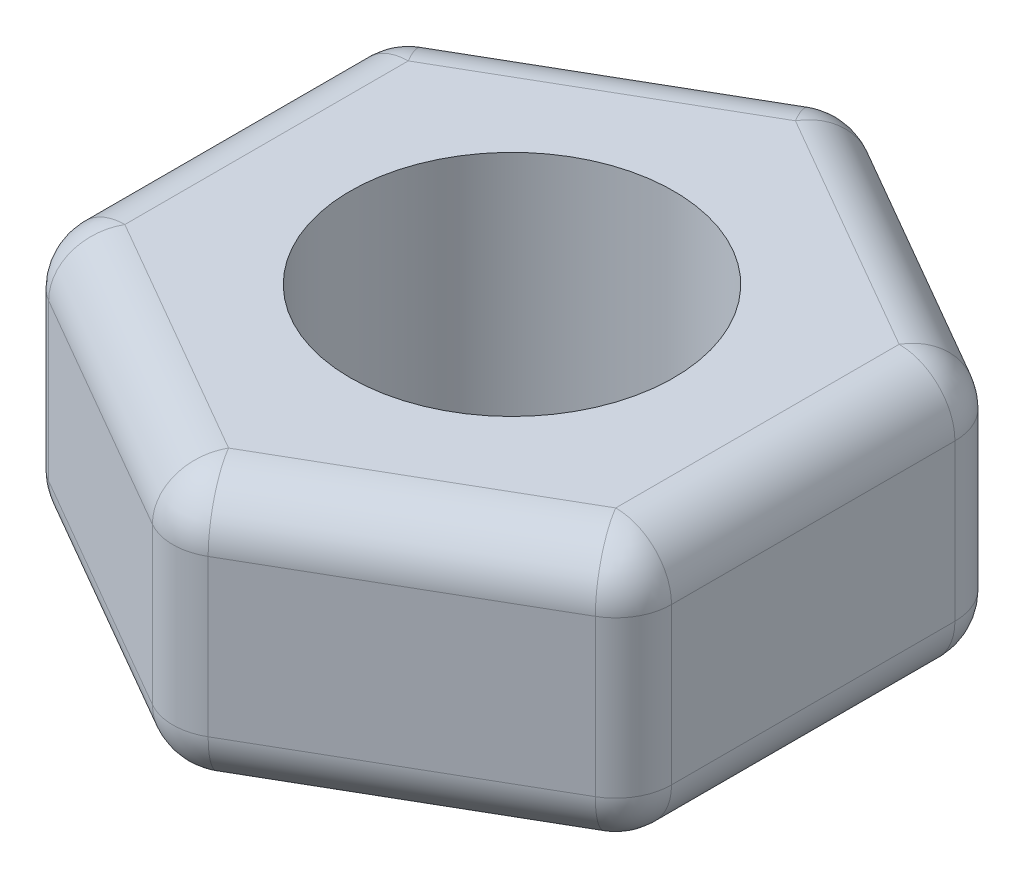
ISO-10303-21;
HEADER;
FILE_DESCRIPTION(('STEP AP214'),'2;1');
FILE_NAME('part.step','',(''),(''),'','','');
FILE_SCHEMA(('AUTOMOTIVE_DESIGN { 1 0 10303 214 1 1 1 1 }'));
ENDSEC;
DATA;
#1=APPLICATION_CONTEXT('core data for automotive mechanical design processes');
#2=APPLICATION_PROTOCOL_DEFINITION('international standard','automotive_design',2000,#1);
#3=PRODUCT_CONTEXT('',#1,'mechanical');
#4=PRODUCT('Part','Part','',(#3));
#5=PRODUCT_RELATED_PRODUCT_CATEGORY('part','',(#4));
#6=PRODUCT_DEFINITION_FORMATION('','',#4);
#7=PRODUCT_DEFINITION_CONTEXT('part definition',#1,'design');
#8=PRODUCT_DEFINITION('design','',#6,#7);
#9=PRODUCT_DEFINITION_SHAPE('','',#8);
#10=(LENGTH_UNIT() NAMED_UNIT(*) SI_UNIT(.MILLI.,.METRE.));
#11=(NAMED_UNIT(*) PLANE_ANGLE_UNIT() SI_UNIT($,.RADIAN.));
#12=(NAMED_UNIT(*) SI_UNIT($,.STERADIAN.) SOLID_ANGLE_UNIT());
#13=UNCERTAINTY_MEASURE_WITH_UNIT(LENGTH_MEASURE(1.E-05),#10,'distance_accuracy_value','');
#14=(GEOMETRIC_REPRESENTATION_CONTEXT(3) GLOBAL_UNCERTAINTY_ASSIGNED_CONTEXT((#13)) GLOBAL_UNIT_ASSIGNED_CONTEXT((#10,
#11,#12)) REPRESENTATION_CONTEXT('',''));
#15=CARTESIAN_POINT('',(0.,0.,0.));
#16=DIRECTION('',(0.,0.,1.));
#17=DIRECTION('',(1.,0.,0.));
#18=AXIS2_PLACEMENT_3D('',#15,#16,#17);
#19=CARTESIAN_POINT('',(0.,2.4,0.));
#20=DIRECTION('',(0.,1.,0.));
#21=DIRECTION('',(0.,0.,1.));
#22=AXIS2_PLACEMENT_3D('',#19,#20,#21);
#23=PLANE('',#22);
#24=DIRECTION('',(-0.866025403784438,0.,0.500000000000001));
#25=VECTOR('',#24,1.);
#26=CARTESIAN_POINT('',(-2.45000000000001,2.4,-1.12583302491977));
#27=LINE('',#26,#25);
#28=CARTESIAN_POINT('',(0.,2.4,-2.54034118443436));
#29=VERTEX_POINT('',#28);
#30=CARTESIAN_POINT('',(-2.20000000000001,2.4,-1.27017059221717));
#31=VERTEX_POINT('',#30);
#32=EDGE_CURVE('E43',#29,#31,#27,.T.);
#33=ORIENTED_EDGE('',*,*,#32,.T.);
#34=DIRECTION('',(0.,0.,1.));
#35=VECTOR('',#34,1.);
#36=CARTESIAN_POINT('',(-2.2,2.4,1.558845726812));
#37=LINE('',#36,#35);
#38=CARTESIAN_POINT('',(-2.2,2.4,1.27017059221719));
#39=VERTEX_POINT('',#38);
#40=EDGE_CURVE('E11',#31,#39,#37,.T.);
#41=ORIENTED_EDGE('',*,*,#40,.T.);
#42=DIRECTION('',(0.866025403784442,0.,0.499999999999995));
#43=VECTOR('',#42,1.);
#44=CARTESIAN_POINT('',(0.25000000000002,2.4,2.68467875173176));
#45=LINE('',#44,#43);
#46=CARTESIAN_POINT('',(0.,2.4,2.54034118443435));
#47=VERTEX_POINT('',#46);
#48=EDGE_CURVE('E267',#39,#47,#45,.T.);
#49=ORIENTED_EDGE('',*,*,#48,.T.);
#50=DIRECTION('',(0.866025403784435,0.,-0.500000000000007));
#51=VECTOR('',#50,1.);
#52=CARTESIAN_POINT('',(2.45000000000001,2.4,1.12583302491975));
#53=LINE('',#52,#51);
#54=CARTESIAN_POINT('',(2.20000000000001,2.4,1.27017059221716));
#55=VERTEX_POINT('',#54);
#56=EDGE_CURVE('E265',#47,#55,#53,.T.);
#57=ORIENTED_EDGE('',*,*,#56,.T.);
#58=DIRECTION('',(0.,0.,-1.));
#59=VECTOR('',#58,1.);
#60=CARTESIAN_POINT('',(2.19999999999998,2.4,-1.55884572681202));
#61=LINE('',#60,#59);
#62=CARTESIAN_POINT('',(2.19999999999999,2.4,-1.27017059221721));
#63=VERTEX_POINT('',#62);
#64=EDGE_CURVE('E270',#55,#63,#61,.T.);
#65=ORIENTED_EDGE('',*,*,#64,.T.);
#66=DIRECTION('',(-0.866025403784442,0.,-0.499999999999995));
#67=VECTOR('',#66,1.);
#68=CARTESIAN_POINT('',(-0.249999999999998,2.4,-2.68467875173176));
#69=LINE('',#68,#67);
#70=EDGE_CURVE('E54',#63,#29,#69,.T.);
#71=ORIENTED_EDGE('',*,*,#70,.T.);
#72=EDGE_LOOP('',(#33,#41,#49,#57,#65,#71));
#73=FACE_BOUND('',#72,.T.);
#74=CARTESIAN_POINT('',(0.,2.4,0.));
#75=DIRECTION('',(0.,1.,0.));
#76=DIRECTION('',(0.,0.,1.));
#77=AXIS2_PLACEMENT_3D('',#74,#75,#76);
#78=CIRCLE('',#77,1.45);
#79=CARTESIAN_POINT('',(0.,2.4,1.45));
#80=VERTEX_POINT('',#79);
#81=EDGE_CURVE('E191',#80,#80,#78,.T.);
#82=ORIENTED_EDGE('',*,*,#81,.F.);
#83=EDGE_LOOP('',(#82));
#84=FACE_BOUND('',#83,.T.);
#85=ADVANCED_FACE('F34',(#73,#84),#23,.T.);
#86=CARTESIAN_POINT('',(0.,0.,0.));
#87=DIRECTION('',(0.,1.,0.));
#88=DIRECTION('',(0.,0.,1.));
#89=AXIS2_PLACEMENT_3D('',#86,#87,#88);
#90=PLANE('',#89);
#91=DIRECTION('',(0.,0.,1.));
#92=VECTOR('',#91,1.);
#93=CARTESIAN_POINT('',(-2.2,0.,0.));
#94=LINE('',#93,#92);
#95=CARTESIAN_POINT('',(-2.2,0.,1.27017059221719));
#96=VERTEX_POINT('',#95);
#97=CARTESIAN_POINT('',(-2.20000000000001,0.,-1.27017059221717));
#98=VERTEX_POINT('',#97);
#99=EDGE_CURVE('E211',#96,#98,#94,.F.);
#100=ORIENTED_EDGE('',*,*,#99,.T.);
#101=DIRECTION('',(-0.866025403784438,0.,0.500000000000001));
#102=VECTOR('',#101,1.);
#103=CARTESIAN_POINT('',(-1.1,0.,-1.90525588832576));
#104=LINE('',#103,#102);
#105=CARTESIAN_POINT('',(0.,0.,-2.54034118443436));
#106=VERTEX_POINT('',#105);
#107=EDGE_CURVE('E213',#98,#106,#104,.F.);
#108=ORIENTED_EDGE('',*,*,#107,.T.);
#109=DIRECTION('',(-0.866025403784442,0.,-0.499999999999995));
#110=VECTOR('',#109,1.);
#111=CARTESIAN_POINT('',(1.09999999999999,0.,-1.90525588832578));
#112=LINE('',#111,#110);
#113=CARTESIAN_POINT('',(2.19999999999999,0.,-1.27017059221721));
#114=VERTEX_POINT('',#113);
#115=EDGE_CURVE('E203',#106,#114,#112,.F.);
#116=ORIENTED_EDGE('',*,*,#115,.T.);
#117=DIRECTION('',(0.,0.,-1.));
#118=VECTOR('',#117,1.);
#119=CARTESIAN_POINT('',(2.2,0.,0.));
#120=LINE('',#119,#118);
#121=CARTESIAN_POINT('',(2.20000000000001,0.,1.27017059221716));
#122=VERTEX_POINT('',#121);
#123=EDGE_CURVE('E201',#114,#122,#120,.F.);
#124=ORIENTED_EDGE('',*,*,#123,.T.);
#125=DIRECTION('',(0.866025403784435,0.,-0.500000000000007));
#126=VECTOR('',#125,1.);
#127=CARTESIAN_POINT('',(1.10000000000001,0.,1.90525588832576));
#128=LINE('',#127,#126);
#129=CARTESIAN_POINT('',(0.,0.,2.54034118443435));
#130=VERTEX_POINT('',#129);
#131=EDGE_CURVE('E205',#122,#130,#128,.F.);
#132=ORIENTED_EDGE('',*,*,#131,.T.);
#133=DIRECTION('',(0.866025403784442,0.,0.499999999999995));
#134=VECTOR('',#133,1.);
#135=CARTESIAN_POINT('',(-1.09999999999999,0.,1.90525588832577));
#136=LINE('',#135,#134);
#137=EDGE_CURVE('E208',#130,#96,#136,.F.);
#138=ORIENTED_EDGE('',*,*,#137,.T.);
#139=EDGE_LOOP('',(#100,#108,#116,#124,#132,#138));
#140=FACE_BOUND('',#139,.T.);
#141=CARTESIAN_POINT('',(0.,0.,0.));
#142=DIRECTION('',(0.,1.,0.));
#143=DIRECTION('',(0.,0.,1.));
#144=AXIS2_PLACEMENT_3D('',#141,#142,#143);
#145=CIRCLE('',#144,1.45);
#146=CARTESIAN_POINT('',(0.,0.,1.45));
#147=VERTEX_POINT('',#146);
#148=EDGE_CURVE('E195',#147,#147,#145,.T.);
#149=ORIENTED_EDGE('',*,*,#148,.T.);
#150=EDGE_LOOP('',(#149));
#151=FACE_BOUND('',#150,.T.);
#152=ADVANCED_FACE('F372',(#140,#151),#90,.F.);
#153=CARTESIAN_POINT('',(2.69999999999998,2.4,-1.55884572681202));
#154=DIRECTION('',(-0.499999999999995,0.,0.866025403784441));
#155=DIRECTION('',(0.866025403784442,0.,0.499999999999995));
#156=AXIS2_PLACEMENT_3D('',#153,#154,#155);
#157=PLANE('',#156);
#158=DIRECTION('',(-0.866025403784442,0.,-0.499999999999995));
#159=VECTOR('',#158,1.);
#160=CARTESIAN_POINT('',(2.69999999999998,1.9,-1.55884572681202));
#161=LINE('',#160,#159);
#162=CARTESIAN_POINT('',(0.249999999999999,1.9,-2.97335388632658));
#163=VERTEX_POINT('',#162);
#164=CARTESIAN_POINT('',(2.44999999999998,1.9,-1.70318329410943));
#165=VERTEX_POINT('',#164);
#166=EDGE_CURVE('E247',#163,#165,#161,.F.);
#167=ORIENTED_EDGE('',*,*,#166,.T.);
#168=DIRECTION('',(0.,-1.,0.));
#169=VECTOR('',#168,1.);
#170=CARTESIAN_POINT('',(2.44999999999998,2.4,-1.70318329410943));
#171=LINE('',#170,#169);
#172=CARTESIAN_POINT('',(2.44999999999998,0.5,-1.70318329410943));
#173=VERTEX_POINT('',#172);
#174=EDGE_CURVE('E252',#165,#173,#171,.T.);
#175=ORIENTED_EDGE('',*,*,#174,.T.);
#176=DIRECTION('',(-0.866025403784442,0.,-0.499999999999995));
#177=VECTOR('',#176,1.);
#178=CARTESIAN_POINT('',(2.69999999999998,0.5,-1.55884572681202));
#179=LINE('',#178,#177);
#180=CARTESIAN_POINT('',(0.249999999999999,0.5,-2.97335388632658));
#181=VERTEX_POINT('',#180);
#182=EDGE_CURVE('E249',#173,#181,#179,.T.);
#183=ORIENTED_EDGE('',*,*,#182,.T.);
#184=DIRECTION('',(0.,-1.,0.));
#185=VECTOR('',#184,1.);
#186=CARTESIAN_POINT('',(0.249999999999999,2.4,-2.97335388632658));
#187=LINE('',#186,#185);
#188=EDGE_CURVE('E245',#181,#163,#187,.F.);
#189=ORIENTED_EDGE('',*,*,#188,.T.);
#190=EDGE_LOOP('',(#167,#175,#183,#189));
#191=FACE_BOUND('',#190,.T.);
#192=ADVANCED_FACE('F393',(#191),#157,.F.);
#193=CARTESIAN_POINT('',(0.,2.4,-3.11769145362398));
#194=DIRECTION('',(0.500000000000001,0.,0.866025403784438));
#195=DIRECTION('',(0.866025403784438,0.,-0.500000000000001));
#196=AXIS2_PLACEMENT_3D('',#193,#194,#195);
#197=PLANE('',#196);
#198=DIRECTION('',(-0.866025403784438,0.,0.500000000000001));
#199=VECTOR('',#198,1.);
#200=CARTESIAN_POINT('',(0.,0.5,-3.11769145362398));
#201=LINE('',#200,#199);
#202=CARTESIAN_POINT('',(-0.249999999999999,0.5,-2.97335388632658));
#203=VERTEX_POINT('',#202);
#204=CARTESIAN_POINT('',(-2.45000000000001,0.5,-1.70318329410939));
#205=VERTEX_POINT('',#204);
#206=EDGE_CURVE('E168',#203,#205,#201,.T.);
#207=ORIENTED_EDGE('',*,*,#206,.T.);
#208=DIRECTION('',(0.,-1.,0.));
#209=VECTOR('',#208,1.);
#210=CARTESIAN_POINT('',(-2.45000000000001,2.4,-1.70318329410939));
#211=LINE('',#210,#209);
#212=CARTESIAN_POINT('',(-2.45000000000001,1.9,-1.70318329410939));
#213=VERTEX_POINT('',#212);
#214=EDGE_CURVE('E164',#205,#213,#211,.F.);
#215=ORIENTED_EDGE('',*,*,#214,.T.);
#216=DIRECTION('',(-0.866025403784438,0.,0.500000000000001));
#217=VECTOR('',#216,1.);
#218=CARTESIAN_POINT('',(0.,1.9,-3.11769145362398));
#219=LINE('',#218,#217);
#220=CARTESIAN_POINT('',(-0.249999999999999,1.9,-2.97335388632658));
#221=VERTEX_POINT('',#220);
#222=EDGE_CURVE('E156',#213,#221,#219,.F.);
#223=ORIENTED_EDGE('',*,*,#222,.T.);
#224=DIRECTION('',(0.,-1.,0.));
#225=VECTOR('',#224,1.);
#226=CARTESIAN_POINT('',(-0.249999999999999,2.4,-2.97335388632658));
#227=LINE('',#226,#225);
#228=EDGE_CURVE('E161',#221,#203,#227,.T.);
#229=ORIENTED_EDGE('',*,*,#228,.T.);
#230=EDGE_LOOP('',(#207,#215,#223,#229));
#231=FACE_BOUND('',#230,.T.);
#232=ADVANCED_FACE('F159',(#231),#197,.F.);
#233=CARTESIAN_POINT('',(-2.70000000000001,2.4,-1.55884572681198));
#234=DIRECTION('',(1.,0.,0.));
#235=DIRECTION('',(0.,0.,-1.));
#236=AXIS2_PLACEMENT_3D('',#233,#234,#235);
#237=PLANE('',#236);
#238=DIRECTION('',(0.,0.,1.));
#239=VECTOR('',#238,1.);
#240=CARTESIAN_POINT('',(-2.70000000000001,0.5,-1.55884572681198));
#241=LINE('',#240,#239);
#242=CARTESIAN_POINT('',(-2.70000000000001,0.5,-1.27017059221717));
#243=VERTEX_POINT('',#242);
#244=CARTESIAN_POINT('',(-2.7,0.5,1.27017059221719));
#245=VERTEX_POINT('',#244);
#246=EDGE_CURVE('E220',#243,#245,#241,.T.);
#247=ORIENTED_EDGE('',*,*,#246,.T.);
#248=DIRECTION('',(0.,-1.,0.));
#249=VECTOR('',#248,1.);
#250=CARTESIAN_POINT('',(-2.7,2.4,1.27017059221719));
#251=LINE('',#250,#249);
#252=CARTESIAN_POINT('',(-2.7,1.9,1.27017059221719));
#253=VERTEX_POINT('',#252);
#254=EDGE_CURVE('E223',#245,#253,#251,.F.);
#255=ORIENTED_EDGE('',*,*,#254,.T.);
#256=DIRECTION('',(0.,0.,1.));
#257=VECTOR('',#256,1.);
#258=CARTESIAN_POINT('',(-2.70000000000001,1.9,-1.55884572681198));
#259=LINE('',#258,#257);
#260=CARTESIAN_POINT('',(-2.70000000000001,1.9,-1.27017059221717));
#261=VERTEX_POINT('',#260);
#262=EDGE_CURVE('E218',#253,#261,#259,.F.);
#263=ORIENTED_EDGE('',*,*,#262,.T.);
#264=DIRECTION('',(0.,-1.,0.));
#265=VECTOR('',#264,1.);
#266=CARTESIAN_POINT('',(-2.70000000000001,2.4,-1.27017059221717));
#267=LINE('',#266,#265);
#268=EDGE_CURVE('E216',#261,#243,#267,.T.);
#269=ORIENTED_EDGE('',*,*,#268,.T.);
#270=EDGE_LOOP('',(#247,#255,#263,#269));
#271=FACE_BOUND('',#270,.T.);
#272=ADVANCED_FACE('F404',(#271),#237,.F.);
#273=CARTESIAN_POINT('',(-2.7,2.4,1.558845726812));
#274=DIRECTION('',(0.499999999999995,0.,-0.866025403784442));
#275=DIRECTION('',(-0.866025403784442,0.,-0.499999999999995));
#276=AXIS2_PLACEMENT_3D('',#273,#274,#275);
#277=PLANE('',#276);
#278=DIRECTION('',(0.866025403784442,0.,0.499999999999995));
#279=VECTOR('',#278,1.);
#280=CARTESIAN_POINT('',(-2.7,1.9,1.558845726812));
#281=LINE('',#280,#279);
#282=CARTESIAN_POINT('',(-0.24999999999998,1.9,2.97335388632658));
#283=VERTEX_POINT('',#282);
#284=CARTESIAN_POINT('',(-2.44999999999999,1.9,1.70318329410941));
#285=VERTEX_POINT('',#284);
#286=EDGE_CURVE('E227',#283,#285,#281,.F.);
#287=ORIENTED_EDGE('',*,*,#286,.T.);
#288=DIRECTION('',(0.,-1.,0.));
#289=VECTOR('',#288,1.);
#290=CARTESIAN_POINT('',(-2.44999999999999,2.4,1.70318329410941));
#291=LINE('',#290,#289);
#292=CARTESIAN_POINT('',(-2.44999999999999,0.5,1.70318329410941));
#293=VERTEX_POINT('',#292);
#294=EDGE_CURVE('E233',#285,#293,#291,.T.);
#295=ORIENTED_EDGE('',*,*,#294,.T.);
#296=DIRECTION('',(0.866025403784442,0.,0.499999999999995));
#297=VECTOR('',#296,1.);
#298=CARTESIAN_POINT('',(-2.7,0.5,1.558845726812));
#299=LINE('',#298,#297);
#300=CARTESIAN_POINT('',(-0.24999999999998,0.5,2.97335388632658));
#301=VERTEX_POINT('',#300);
#302=EDGE_CURVE('E230',#293,#301,#299,.T.);
#303=ORIENTED_EDGE('',*,*,#302,.T.);
#304=DIRECTION('',(0.,-1.,0.));
#305=VECTOR('',#304,1.);
#306=CARTESIAN_POINT('',(-0.24999999999998,2.4,2.97335388632658));
#307=LINE('',#306,#305);
#308=EDGE_CURVE('E225',#301,#283,#307,.F.);
#309=ORIENTED_EDGE('',*,*,#308,.T.);
#310=EDGE_LOOP('',(#287,#295,#303,#309));
#311=FACE_BOUND('',#310,.T.);
#312=ADVANCED_FACE('F400',(#311),#277,.F.);
#313=CARTESIAN_POINT('',(0.,2.4,3.11769145362398));
#314=DIRECTION('',(-0.500000000000007,0.,-0.866025403784435));
#315=DIRECTION('',(-0.866025403784435,0.,0.500000000000007));
#316=AXIS2_PLACEMENT_3D('',#313,#314,#315);
#317=PLANE('',#316);
#318=DIRECTION('',(0.866025403784435,0.,-0.500000000000007));
#319=VECTOR('',#318,1.);
#320=CARTESIAN_POINT('',(0.,0.5,3.11769145362398));
#321=LINE('',#320,#319);
#322=CARTESIAN_POINT('',(0.250000000000021,0.5,2.97335388632657));
#323=VERTEX_POINT('',#322);
#324=CARTESIAN_POINT('',(2.45000000000002,0.5,1.70318329410937));
#325=VERTEX_POINT('',#324);
#326=EDGE_CURVE('E239',#323,#325,#321,.T.);
#327=ORIENTED_EDGE('',*,*,#326,.T.);
#328=DIRECTION('',(0.,-1.,0.));
#329=VECTOR('',#328,1.);
#330=CARTESIAN_POINT('',(2.45000000000002,2.4,1.70318329410937));
#331=LINE('',#330,#329);
#332=CARTESIAN_POINT('',(2.45000000000002,1.9,1.70318329410937));
#333=VERTEX_POINT('',#332);
#334=EDGE_CURVE('E242',#325,#333,#331,.F.);
#335=ORIENTED_EDGE('',*,*,#334,.T.);
#336=DIRECTION('',(0.866025403784435,0.,-0.500000000000007));
#337=VECTOR('',#336,1.);
#338=CARTESIAN_POINT('',(0.,1.9,3.11769145362398));
#339=LINE('',#338,#337);
#340=CARTESIAN_POINT('',(0.250000000000021,1.9,2.97335388632657));
#341=VERTEX_POINT('',#340);
#342=EDGE_CURVE('E237',#333,#341,#339,.F.);
#343=ORIENTED_EDGE('',*,*,#342,.T.);
#344=DIRECTION('',(0.,-1.,0.));
#345=VECTOR('',#344,1.);
#346=CARTESIAN_POINT('',(0.250000000000021,2.4,2.97335388632657));
#347=LINE('',#346,#345);
#348=EDGE_CURVE('E235',#341,#323,#347,.T.);
#349=ORIENTED_EDGE('',*,*,#348,.T.);
#350=EDGE_LOOP('',(#327,#335,#343,#349));
#351=FACE_BOUND('',#350,.T.);
#352=ADVANCED_FACE('F385',(#351),#317,.F.);
#353=CARTESIAN_POINT('',(2.70000000000002,2.4,1.55884572681197));
#354=DIRECTION('',(-1.,0.,0.));
#355=DIRECTION('',(0.,0.,1.));
#356=AXIS2_PLACEMENT_3D('',#353,#354,#355);
#357=PLANE('',#356);
#358=DIRECTION('',(0.,0.,-1.));
#359=VECTOR('',#358,1.);
#360=CARTESIAN_POINT('',(2.70000000000002,0.5,1.55884572681197));
#361=LINE('',#360,#359);
#362=CARTESIAN_POINT('',(2.70000000000001,0.5,1.27017059221715));
#363=VERTEX_POINT('',#362);
#364=CARTESIAN_POINT('',(2.69999999999999,0.5,-1.27017059221721));
#365=VERTEX_POINT('',#364);
#366=EDGE_CURVE('E259',#363,#365,#361,.T.);
#367=ORIENTED_EDGE('',*,*,#366,.T.);
#368=DIRECTION('',(0.,-1.,0.));
#369=VECTOR('',#368,1.);
#370=CARTESIAN_POINT('',(2.69999999999999,2.4,-1.27017059221721));
#371=LINE('',#370,#369);
#372=CARTESIAN_POINT('',(2.69999999999999,1.9,-1.27017059221721));
#373=VERTEX_POINT('',#372);
#374=EDGE_CURVE('E263',#365,#373,#371,.F.);
#375=ORIENTED_EDGE('',*,*,#374,.T.);
#376=DIRECTION('',(0.,0.,-1.));
#377=VECTOR('',#376,1.);
#378=CARTESIAN_POINT('',(2.70000000000002,1.9,1.55884572681197));
#379=LINE('',#378,#377);
#380=CARTESIAN_POINT('',(2.70000000000001,1.9,1.27017059221715));
#381=VERTEX_POINT('',#380);
#382=EDGE_CURVE('E257',#373,#381,#379,.F.);
#383=ORIENTED_EDGE('',*,*,#382,.T.);
#384=DIRECTION('',(0.,-1.,0.));
#385=VECTOR('',#384,1.);
#386=CARTESIAN_POINT('',(2.70000000000001,2.4,1.27017059221715));
#387=LINE('',#386,#385);
#388=EDGE_CURVE('E254',#381,#363,#387,.T.);
#389=ORIENTED_EDGE('',*,*,#388,.T.);
#390=EDGE_LOOP('',(#367,#375,#383,#389));
#391=FACE_BOUND('',#390,.T.);
#392=ADVANCED_FACE('F376',(#391),#357,.F.);
#393=CARTESIAN_POINT('',(0.,2.4,0.));
#394=DIRECTION('',(0.,-1.,0.));
#395=DIRECTION('',(0.,0.,-1.));
#396=AXIS2_PLACEMENT_3D('',#393,#394,#395);
#397=CYLINDRICAL_SURFACE('',#396,1.45);
#398=ORIENTED_EDGE('',*,*,#81,.T.);
#399=EDGE_LOOP('',(#398));
#400=FACE_BOUND('',#399,.T.);
#401=ORIENTED_EDGE('',*,*,#148,.F.);
#402=EDGE_LOOP('',(#401));
#403=FACE_BOUND('',#402,.T.);
#404=ADVANCED_FACE('F374',(#400,#403),#397,.F.);
#405=CARTESIAN_POINT('',(1.10000000000001,1.9,1.90525588832576));
#406=DIRECTION('',(-0.866025403784435,0.,0.500000000000007));
#407=DIRECTION('',(0.500000000000007,0.,0.866025403784435));
#408=AXIS2_PLACEMENT_3D('',#405,#406,#407);
#409=CYLINDRICAL_SURFACE('',#408,0.5);
#410=CARTESIAN_POINT('',(2.20000000000001,1.9,1.27017059221716));
#411=DIRECTION('',(0.866025403784435,0.,-0.500000000000006));
#412=DIRECTION('',(-0.500000000000006,0.,-0.866025403784435));
#413=AXIS2_PLACEMENT_3D('',#410,#411,#412);
#414=CIRCLE('',#413,0.5);
#415=EDGE_CURVE('E38',#55,#333,#414,.T.);
#416=ORIENTED_EDGE('',*,*,#415,.F.);
#417=ORIENTED_EDGE('',*,*,#56,.F.);
#418=CARTESIAN_POINT('',(0.,1.9,2.54034118443435));
#419=DIRECTION('',(-0.866025403784435,0.,0.500000000000007));
#420=DIRECTION('',(0.500000000000007,0.,0.866025403784435));
#421=AXIS2_PLACEMENT_3D('',#418,#419,#420);
#422=CIRCLE('',#421,0.5);
#423=EDGE_CURVE('E356',#341,#47,#422,.T.);
#424=ORIENTED_EDGE('',*,*,#423,.F.);
#425=ORIENTED_EDGE('',*,*,#342,.F.);
#426=EDGE_LOOP('',(#416,#417,#424,#425));
#427=FACE_BOUND('',#426,.T.);
#428=ADVANCED_FACE('F36',(#427),#409,.T.);
#429=CARTESIAN_POINT('',(2.20000000000001,1.9,1.27017059221716));
#430=DIRECTION('',(0.,1.,0.));
#431=DIRECTION('',(0.,0.,1.));
#432=AXIS2_PLACEMENT_3D('',#429,#430,#431);
#433=SPHERICAL_SURFACE('',#432,0.5);
#434=CARTESIAN_POINT('',(2.20000000000001,1.9,1.27017059221716));
#435=DIRECTION('',(0.,0.,1.));
#436=DIRECTION('',(1.,0.,0.));
#437=AXIS2_PLACEMENT_3D('',#434,#435,#436);
#438=CIRCLE('',#437,0.5);
#439=EDGE_CURVE('E351',#55,#381,#438,.F.);
#440=ORIENTED_EDGE('',*,*,#439,.F.);
#441=ORIENTED_EDGE('',*,*,#415,.T.);
#442=CARTESIAN_POINT('',(2.20000000000001,1.9,1.27017059221716));
#443=DIRECTION('',(0.,1.,0.));
#444=DIRECTION('',(0.,0.,1.));
#445=AXIS2_PLACEMENT_3D('',#442,#443,#444);
#446=CIRCLE('',#445,0.5);
#447=EDGE_CURVE('E354',#381,#333,#446,.F.);
#448=ORIENTED_EDGE('',*,*,#447,.F.);
#449=EDGE_LOOP('',(#440,#441,#448));
#450=FACE_BOUND('',#449,.T.);
#451=ADVANCED_FACE('F383',(#450),#433,.T.);
#452=CARTESIAN_POINT('',(0.,1.9,2.54034118443435));
#453=DIRECTION('',(0.,1.,0.));
#454=DIRECTION('',(-1.,0.,0.));
#455=AXIS2_PLACEMENT_3D('',#452,#453,#454);
#456=SPHERICAL_SURFACE('',#455,0.5);
#457=CARTESIAN_POINT('',(0.,1.9,2.54034118443435));
#458=DIRECTION('',(0.,1.,0.));
#459=DIRECTION('',(0.,0.,1.));
#460=AXIS2_PLACEMENT_3D('',#457,#458,#459);
#461=CIRCLE('',#460,0.5);
#462=EDGE_CURVE('E345',#341,#283,#461,.F.);
#463=ORIENTED_EDGE('',*,*,#462,.F.);
#464=ORIENTED_EDGE('',*,*,#423,.T.);
#465=CARTESIAN_POINT('',(0.,1.9,2.54034118443435));
#466=DIRECTION('',(0.866025403784442,0.,0.499999999999994));
#467=DIRECTION('',(0.499999999999994,0.,-0.866025403784442));
#468=AXIS2_PLACEMENT_3D('',#465,#466,#467);
#469=CIRCLE('',#468,0.5);
#470=EDGE_CURVE('E348',#283,#47,#469,.F.);
#471=ORIENTED_EDGE('',*,*,#470,.F.);
#472=EDGE_LOOP('',(#463,#464,#471));
#473=FACE_BOUND('',#472,.T.);
#474=ADVANCED_FACE('F515',(#473),#456,.T.);
#475=CARTESIAN_POINT('',(2.20000000000001,2.4,1.27017059221716));
#476=DIRECTION('',(0.,-1.,0.));
#477=DIRECTION('',(0.,0.,-1.));
#478=AXIS2_PLACEMENT_3D('',#475,#476,#477);
#479=CYLINDRICAL_SURFACE('',#478,0.5);
#480=ORIENTED_EDGE('',*,*,#447,.T.);
#481=ORIENTED_EDGE('',*,*,#334,.F.);
#482=CARTESIAN_POINT('',(2.20000000000001,0.5,1.27017059221716));
#483=DIRECTION('',(0.,-1.,0.));
#484=DIRECTION('',(0.,0.,-1.));
#485=AXIS2_PLACEMENT_3D('',#482,#483,#484);
#486=CIRCLE('',#485,0.5);
#487=EDGE_CURVE('E340',#363,#325,#486,.T.);
#488=ORIENTED_EDGE('',*,*,#487,.F.);
#489=ORIENTED_EDGE('',*,*,#388,.F.);
#490=EDGE_LOOP('',(#480,#481,#488,#489));
#491=FACE_BOUND('',#490,.T.);
#492=ADVANCED_FACE('F511',(#491),#479,.T.);
#493=CARTESIAN_POINT('',(2.2,1.9,0.));
#494=DIRECTION('',(0.,0.,1.));
#495=DIRECTION('',(1.,0.,0.));
#496=AXIS2_PLACEMENT_3D('',#493,#494,#495);
#497=CYLINDRICAL_SURFACE('',#496,0.5);
#498=ORIENTED_EDGE('',*,*,#439,.T.);
#499=ORIENTED_EDGE('',*,*,#382,.F.);
#500=CARTESIAN_POINT('',(2.19999999999999,1.9,-1.27017059221721));
#501=DIRECTION('',(0.,0.,-1.));
#502=DIRECTION('',(-1.,0.,0.));
#503=AXIS2_PLACEMENT_3D('',#500,#501,#502);
#504=CIRCLE('',#503,0.5);
#505=EDGE_CURVE('E337',#63,#373,#504,.T.);
#506=ORIENTED_EDGE('',*,*,#505,.F.);
#507=ORIENTED_EDGE('',*,*,#64,.F.);
#508=EDGE_LOOP('',(#498,#499,#506,#507));
#509=FACE_BOUND('',#508,.T.);
#510=ADVANCED_FACE('F507',(#509),#497,.T.);
#511=CARTESIAN_POINT('',(-1.09999999999999,1.9,1.90525588832577));
#512=DIRECTION('',(-0.866025403784442,0.,-0.499999999999995));
#513=DIRECTION('',(-0.499999999999995,0.,0.866025403784442));
#514=AXIS2_PLACEMENT_3D('',#511,#512,#513);
#515=CYLINDRICAL_SURFACE('',#514,0.5);
#516=ORIENTED_EDGE('',*,*,#470,.T.);
#517=ORIENTED_EDGE('',*,*,#48,.F.);
#518=CARTESIAN_POINT('',(-2.2,1.9,1.27017059221719));
#519=DIRECTION('',(-0.866025403784441,0.,-0.499999999999995));
#520=DIRECTION('',(-0.499999999999995,0.,0.866025403784441));
#521=AXIS2_PLACEMENT_3D('',#518,#519,#520);
#522=CIRCLE('',#521,0.5);
#523=EDGE_CURVE('E334',#285,#39,#522,.T.);
#524=ORIENTED_EDGE('',*,*,#523,.F.);
#525=ORIENTED_EDGE('',*,*,#286,.F.);
#526=EDGE_LOOP('',(#516,#517,#524,#525));
#527=FACE_BOUND('',#526,.T.);
#528=ADVANCED_FACE('F503',(#527),#515,.T.);
#529=CARTESIAN_POINT('',(0.,2.4,2.54034118443435));
#530=DIRECTION('',(0.,-1.,0.));
#531=DIRECTION('',(0.,0.,-1.));
#532=AXIS2_PLACEMENT_3D('',#529,#530,#531);
#533=CYLINDRICAL_SURFACE('',#532,0.5);
#534=ORIENTED_EDGE('',*,*,#462,.T.);
#535=ORIENTED_EDGE('',*,*,#308,.F.);
#536=CARTESIAN_POINT('',(0.,0.5,2.54034118443435));
#537=DIRECTION('',(0.,-1.,0.));
#538=DIRECTION('',(0.,0.,-1.));
#539=AXIS2_PLACEMENT_3D('',#536,#537,#538);
#540=CIRCLE('',#539,0.5);
#541=EDGE_CURVE('E331',#323,#301,#540,.T.);
#542=ORIENTED_EDGE('',*,*,#541,.F.);
#543=ORIENTED_EDGE('',*,*,#348,.F.);
#544=EDGE_LOOP('',(#534,#535,#542,#543));
#545=FACE_BOUND('',#544,.T.);
#546=ADVANCED_FACE('F499',(#545),#533,.T.);
#547=CARTESIAN_POINT('',(-0.249999999999982,0.5,2.68467875173176));
#548=DIRECTION('',(0.866025403784435,0.,-0.500000000000007));
#549=DIRECTION('',(-0.500000000000007,0.,-0.866025403784435));
#550=AXIS2_PLACEMENT_3D('',#547,#548,#549);
#551=CYLINDRICAL_SURFACE('',#550,0.5);
#552=CARTESIAN_POINT('',(2.20000000000001,0.5,1.27017059221716));
#553=DIRECTION('',(0.866025403784434,0.,-0.500000000000007));
#554=DIRECTION('',(-0.500000000000007,0.,-0.866025403784434));
#555=AXIS2_PLACEMENT_3D('',#552,#553,#554);
#556=CIRCLE('',#555,0.5);
#557=EDGE_CURVE('E342',#325,#122,#556,.T.);
#558=ORIENTED_EDGE('',*,*,#557,.F.);
#559=ORIENTED_EDGE('',*,*,#326,.F.);
#560=CARTESIAN_POINT('',(0.,0.5,2.54034118443435));
#561=DIRECTION('',(-0.866025403784435,0.,0.500000000000007));
#562=DIRECTION('',(0.500000000000007,0.,0.866025403784435));
#563=AXIS2_PLACEMENT_3D('',#560,#561,#562);
#564=CIRCLE('',#563,0.5);
#565=EDGE_CURVE('E328',#130,#323,#564,.T.);
#566=ORIENTED_EDGE('',*,*,#565,.F.);
#567=ORIENTED_EDGE('',*,*,#131,.F.);
#568=EDGE_LOOP('',(#558,#559,#566,#567));
#569=FACE_BOUND('',#568,.T.);
#570=ADVANCED_FACE('F495',(#569),#551,.T.);
#571=CARTESIAN_POINT('',(2.20000000000001,0.5,1.27017059221716));
#572=DIRECTION('',(0.,-1.,0.));
#573=DIRECTION('',(0.,0.,-1.));
#574=AXIS2_PLACEMENT_3D('',#571,#572,#573);
#575=SPHERICAL_SURFACE('',#574,0.5);
#576=ORIENTED_EDGE('',*,*,#487,.T.);
#577=ORIENTED_EDGE('',*,*,#557,.T.);
#578=CARTESIAN_POINT('',(2.20000000000001,0.5,1.27017059221716));
#579=DIRECTION('',(0.,0.,1.));
#580=DIRECTION('',(1.,0.,0.));
#581=AXIS2_PLACEMENT_3D('',#578,#579,#580);
#582=CIRCLE('',#581,0.5);
#583=EDGE_CURVE('E325',#363,#122,#582,.F.);
#584=ORIENTED_EDGE('',*,*,#583,.F.);
#585=EDGE_LOOP('',(#576,#577,#584));
#586=FACE_BOUND('',#585,.T.);
#587=ADVANCED_FACE('F491',(#586),#575,.T.);
#588=CARTESIAN_POINT('',(2.19999999999999,1.9,-1.27017059221721));
#589=DIRECTION('',(0.,1.,0.));
#590=DIRECTION('',(-1.,0.,0.));
#591=AXIS2_PLACEMENT_3D('',#588,#589,#590);
#592=SPHERICAL_SURFACE('',#591,0.5);
#593=CARTESIAN_POINT('',(2.19999999999999,1.9,-1.27017059221721));
#594=DIRECTION('',(0.866025403784441,0.,0.499999999999995));
#595=DIRECTION('',(0.499999999999995,0.,-0.866025403784441));
#596=AXIS2_PLACEMENT_3D('',#593,#594,#595);
#597=CIRCLE('',#596,0.5);
#598=EDGE_CURVE('E319',#63,#165,#597,.F.);
#599=ORIENTED_EDGE('',*,*,#598,.F.);
#600=ORIENTED_EDGE('',*,*,#505,.T.);
#601=CARTESIAN_POINT('',(2.19999999999999,1.9,-1.27017059221721));
#602=DIRECTION('',(0.,1.,0.));
#603=DIRECTION('',(0.,0.,1.));
#604=AXIS2_PLACEMENT_3D('',#601,#602,#603);
#605=CIRCLE('',#604,0.5);
#606=EDGE_CURVE('E322',#165,#373,#605,.F.);
#607=ORIENTED_EDGE('',*,*,#606,.F.);
#608=EDGE_LOOP('',(#599,#600,#607));
#609=FACE_BOUND('',#608,.T.);
#610=ADVANCED_FACE('F487',(#609),#592,.T.);
#611=CARTESIAN_POINT('',(-2.2,1.9,1.27017059221719));
#612=DIRECTION('',(0.,1.,0.));
#613=DIRECTION('',(0.,0.,1.));
#614=AXIS2_PLACEMENT_3D('',#611,#612,#613);
#615=SPHERICAL_SURFACE('',#614,0.5);
#616=CARTESIAN_POINT('',(-2.2,1.9,1.27017059221719));
#617=DIRECTION('',(0.,1.,0.));
#618=DIRECTION('',(0.,0.,1.));
#619=AXIS2_PLACEMENT_3D('',#616,#617,#618);
#620=CIRCLE('',#619,0.5);
#621=EDGE_CURVE('E313',#285,#253,#620,.F.);
#622=ORIENTED_EDGE('',*,*,#621,.F.);
#623=ORIENTED_EDGE('',*,*,#523,.T.);
#624=CARTESIAN_POINT('',(-2.2,1.9,1.27017059221719));
#625=DIRECTION('',(0.,0.,1.));
#626=DIRECTION('',(1.,0.,0.));
#627=AXIS2_PLACEMENT_3D('',#624,#625,#626);
#628=CIRCLE('',#627,0.5);
#629=EDGE_CURVE('E316',#253,#39,#628,.F.);
#630=ORIENTED_EDGE('',*,*,#629,.F.);
#631=EDGE_LOOP('',(#622,#623,#630));
#632=FACE_BOUND('',#631,.T.);
#633=ADVANCED_FACE('F483',(#632),#615,.T.);
#634=CARTESIAN_POINT('',(0.,0.5,2.54034118443435));
#635=DIRECTION('',(0.,-1.,0.));
#636=DIRECTION('',(1.,0.,0.));
#637=AXIS2_PLACEMENT_3D('',#634,#635,#636);
#638=SPHERICAL_SURFACE('',#637,0.5);
#639=ORIENTED_EDGE('',*,*,#565,.T.);
#640=ORIENTED_EDGE('',*,*,#541,.T.);
#641=CARTESIAN_POINT('',(0.,0.5,2.54034118443435));
#642=DIRECTION('',(0.866025403784442,0.,0.499999999999995));
#643=DIRECTION('',(0.499999999999995,0.,-0.866025403784442));
#644=AXIS2_PLACEMENT_3D('',#641,#642,#643);
#645=CIRCLE('',#644,0.5);
#646=EDGE_CURVE('E311',#130,#301,#645,.F.);
#647=ORIENTED_EDGE('',*,*,#646,.F.);
#648=EDGE_LOOP('',(#639,#640,#647));
#649=FACE_BOUND('',#648,.T.);
#650=ADVANCED_FACE('F479',(#649),#638,.T.);
#651=CARTESIAN_POINT('',(2.20000000000002,0.5,1.55884572681197));
#652=DIRECTION('',(0.,0.,-1.));
#653=DIRECTION('',(-1.,0.,0.));
#654=AXIS2_PLACEMENT_3D('',#651,#652,#653);
#655=CYLINDRICAL_SURFACE('',#654,0.5);
#656=ORIENTED_EDGE('',*,*,#583,.T.);
#657=ORIENTED_EDGE('',*,*,#123,.F.);
#658=CARTESIAN_POINT('',(2.19999999999999,0.5,-1.27017059221721));
#659=DIRECTION('',(0.,0.,-1.));
#660=DIRECTION('',(-1.,0.,0.));
#661=AXIS2_PLACEMENT_3D('',#658,#659,#660);
#662=CIRCLE('',#661,0.5);
#663=EDGE_CURVE('E308',#365,#114,#662,.T.);
#664=ORIENTED_EDGE('',*,*,#663,.F.);
#665=ORIENTED_EDGE('',*,*,#366,.F.);
#666=EDGE_LOOP('',(#656,#657,#664,#665));
#667=FACE_BOUND('',#666,.T.);
#668=ADVANCED_FACE('F475',(#667),#655,.T.);
#669=CARTESIAN_POINT('',(2.19999999999999,2.4,-1.27017059221721));
#670=DIRECTION('',(0.,-1.,0.));
#671=DIRECTION('',(0.,0.,-1.));
#672=AXIS2_PLACEMENT_3D('',#669,#670,#671);
#673=CYLINDRICAL_SURFACE('',#672,0.5);
#674=ORIENTED_EDGE('',*,*,#606,.T.);
#675=ORIENTED_EDGE('',*,*,#374,.F.);
#676=CARTESIAN_POINT('',(2.19999999999999,0.5,-1.27017059221721));
#677=DIRECTION('',(0.,-1.,0.));
#678=DIRECTION('',(0.,0.,-1.));
#679=AXIS2_PLACEMENT_3D('',#676,#677,#678);
#680=CIRCLE('',#679,0.5);
#681=EDGE_CURVE('E306',#173,#365,#680,.T.);
#682=ORIENTED_EDGE('',*,*,#681,.F.);
#683=ORIENTED_EDGE('',*,*,#174,.F.);
#684=EDGE_LOOP('',(#674,#675,#682,#683));
#685=FACE_BOUND('',#684,.T.);
#686=ADVANCED_FACE('F471',(#685),#673,.T.);
#687=CARTESIAN_POINT('',(1.09999999999999,1.9,-1.90525588832578));
#688=DIRECTION('',(0.866025403784442,0.,0.499999999999995));
#689=DIRECTION('',(0.499999999999995,0.,-0.866025403784441));
#690=AXIS2_PLACEMENT_3D('',#687,#688,#689);
#691=CYLINDRICAL_SURFACE('',#690,0.5);
#692=ORIENTED_EDGE('',*,*,#598,.T.);
#693=ORIENTED_EDGE('',*,*,#166,.F.);
#694=CARTESIAN_POINT('',(0.,1.9,-2.54034118443436));
#695=DIRECTION('',(-0.866025403784441,0.,-0.499999999999995));
#696=DIRECTION('',(-0.499999999999995,0.,0.866025403784442));
#697=AXIS2_PLACEMENT_3D('',#694,#695,#696);
#698=CIRCLE('',#697,0.5);
#699=EDGE_CURVE('E177',#29,#163,#698,.T.);
#700=ORIENTED_EDGE('',*,*,#699,.F.);
#701=ORIENTED_EDGE('',*,*,#70,.F.);
#702=EDGE_LOOP('',(#692,#693,#700,#701));
#703=FACE_BOUND('',#702,.T.);
#704=ADVANCED_FACE('F468',(#703),#691,.T.);
#705=CARTESIAN_POINT('',(-1.1,1.9,-1.90525588832576));
#706=DIRECTION('',(0.866025403784438,0.,-0.500000000000001));
#707=DIRECTION('',(-0.500000000000001,0.,-0.866025403784438));
#708=AXIS2_PLACEMENT_3D('',#705,#706,#707);
#709=CYLINDRICAL_SURFACE('',#708,0.5);
#710=CARTESIAN_POINT('',(-2.20000000000001,1.9,-1.27017059221717));
#711=DIRECTION('',(-0.866025403784438,0.,0.500000000000002));
#712=DIRECTION('',(0.500000000000002,0.,0.866025403784438));
#713=AXIS2_PLACEMENT_3D('',#710,#711,#712);
#714=CIRCLE('',#713,0.5);
#715=EDGE_CURVE('E178',#31,#213,#714,.T.);
#716=ORIENTED_EDGE('',*,*,#715,.F.);
#717=ORIENTED_EDGE('',*,*,#32,.F.);
#718=CARTESIAN_POINT('',(0.,1.9,-2.54034118443436));
#719=DIRECTION('',(0.866025403784438,0.,-0.500000000000001));
#720=DIRECTION('',(-0.500000000000001,0.,-0.866025403784438));
#721=AXIS2_PLACEMENT_3D('',#718,#719,#720);
#722=CIRCLE('',#721,0.5);
#723=EDGE_CURVE('E171',#221,#29,#722,.T.);
#724=ORIENTED_EDGE('',*,*,#723,.F.);
#725=ORIENTED_EDGE('',*,*,#222,.F.);
#726=EDGE_LOOP('',(#716,#717,#724,#725));
#727=FACE_BOUND('',#726,.T.);
#728=ADVANCED_FACE('F173',(#727),#709,.T.);
#729=CARTESIAN_POINT('',(-2.2,1.9,0.));
#730=DIRECTION('',(0.,0.,-1.));
#731=DIRECTION('',(-1.,0.,0.));
#732=AXIS2_PLACEMENT_3D('',#729,#730,#731);
#733=CYLINDRICAL_SURFACE('',#732,0.5);
#734=ORIENTED_EDGE('',*,*,#629,.T.);
#735=ORIENTED_EDGE('',*,*,#40,.F.);
#736=CARTESIAN_POINT('',(-2.20000000000001,1.9,-1.27017059221717));
#737=DIRECTION('',(0.,0.,-1.));
#738=DIRECTION('',(-1.,0.,0.));
#739=AXIS2_PLACEMENT_3D('',#736,#737,#738);
#740=CIRCLE('',#739,0.5);
#741=EDGE_CURVE('E301',#261,#31,#740,.T.);
#742=ORIENTED_EDGE('',*,*,#741,.F.);
#743=ORIENTED_EDGE('',*,*,#262,.F.);
#744=EDGE_LOOP('',(#734,#735,#742,#743));
#745=FACE_BOUND('',#744,.T.);
#746=ADVANCED_FACE('F461',(#745),#733,.T.);
#747=CARTESIAN_POINT('',(-2.2,2.4,1.27017059221719));
#748=DIRECTION('',(0.,-1.,0.));
#749=DIRECTION('',(0.,0.,-1.));
#750=AXIS2_PLACEMENT_3D('',#747,#748,#749);
#751=CYLINDRICAL_SURFACE('',#750,0.5);
#752=ORIENTED_EDGE('',*,*,#621,.T.);
#753=ORIENTED_EDGE('',*,*,#254,.F.);
#754=CARTESIAN_POINT('',(-2.2,0.5,1.27017059221719));
#755=DIRECTION('',(0.,-1.,0.));
#756=DIRECTION('',(0.,0.,-1.));
#757=AXIS2_PLACEMENT_3D('',#754,#755,#756);
#758=CIRCLE('',#757,0.5);
#759=EDGE_CURVE('E298',#293,#245,#758,.T.);
#760=ORIENTED_EDGE('',*,*,#759,.F.);
#761=ORIENTED_EDGE('',*,*,#294,.F.);
#762=EDGE_LOOP('',(#752,#753,#760,#761));
#763=FACE_BOUND('',#762,.T.);
#764=ADVANCED_FACE('F457',(#763),#751,.T.);
#765=CARTESIAN_POINT('',(-2.45,0.5,1.12583302491978));
#766=DIRECTION('',(0.866025403784442,0.,0.499999999999995));
#767=DIRECTION('',(0.499999999999995,0.,-0.866025403784442));
#768=AXIS2_PLACEMENT_3D('',#765,#766,#767);
#769=CYLINDRICAL_SURFACE('',#768,0.5);
#770=ORIENTED_EDGE('',*,*,#646,.T.);
#771=ORIENTED_EDGE('',*,*,#302,.F.);
#772=CARTESIAN_POINT('',(-2.2,0.5,1.27017059221719));
#773=DIRECTION('',(-0.866025403784442,0.,-0.499999999999995));
#774=DIRECTION('',(-0.499999999999995,0.,0.866025403784442));
#775=AXIS2_PLACEMENT_3D('',#772,#773,#774);
#776=CIRCLE('',#775,0.5);
#777=EDGE_CURVE('E295',#96,#293,#776,.T.);
#778=ORIENTED_EDGE('',*,*,#777,.F.);
#779=ORIENTED_EDGE('',*,*,#137,.F.);
#780=EDGE_LOOP('',(#770,#771,#778,#779));
#781=FACE_BOUND('',#780,.T.);
#782=ADVANCED_FACE('F453',(#781),#769,.T.);
#783=CARTESIAN_POINT('',(2.19999999999999,0.5,-1.27017059221721));
#784=DIRECTION('',(0.,-1.,0.));
#785=DIRECTION('',(0.,0.,-1.));
#786=AXIS2_PLACEMENT_3D('',#783,#784,#785);
#787=SPHERICAL_SURFACE('',#786,0.5);
#788=ORIENTED_EDGE('',*,*,#681,.T.);
#789=ORIENTED_EDGE('',*,*,#663,.T.);
#790=CARTESIAN_POINT('',(2.19999999999999,0.5,-1.27017059221721));
#791=DIRECTION('',(0.866025403784441,0.,0.499999999999995));
#792=DIRECTION('',(0.499999999999995,0.,-0.866025403784441));
#793=AXIS2_PLACEMENT_3D('',#790,#791,#792);
#794=CIRCLE('',#793,0.5);
#795=EDGE_CURVE('E185',#173,#114,#794,.F.);
#796=ORIENTED_EDGE('',*,*,#795,.F.);
#797=EDGE_LOOP('',(#788,#789,#796));
#798=FACE_BOUND('',#797,.T.);
#799=ADVANCED_FACE('F450',(#798),#787,.T.);
#800=CARTESIAN_POINT('',(0.,1.9,-2.54034118443436));
#801=DIRECTION('',(0.,1.,0.));
#802=DIRECTION('',(0.,0.,1.));
#803=AXIS2_PLACEMENT_3D('',#800,#801,#802);
#804=SPHERICAL_SURFACE('',#803,0.5);
#805=ORIENTED_EDGE('',*,*,#723,.T.);
#806=ORIENTED_EDGE('',*,*,#699,.T.);
#807=CARTESIAN_POINT('',(0.,1.9,-2.54034118443436));
#808=DIRECTION('',(0.,1.,0.));
#809=DIRECTION('',(0.,0.,1.));
#810=AXIS2_PLACEMENT_3D('',#807,#808,#809);
#811=CIRCLE('',#810,0.5);
#812=EDGE_CURVE('E181',#221,#163,#811,.F.);
#813=ORIENTED_EDGE('',*,*,#812,.F.);
#814=EDGE_LOOP('',(#805,#806,#813));
#815=FACE_BOUND('',#814,.T.);
#816=ADVANCED_FACE('F182',(#815),#804,.T.);
#817=CARTESIAN_POINT('',(-2.20000000000001,1.9,-1.27017059221717));
#818=DIRECTION('',(0.,1.,0.));
#819=DIRECTION('',(0.,0.,1.));
#820=AXIS2_PLACEMENT_3D('',#817,#818,#819);
#821=SPHERICAL_SURFACE('',#820,0.5);
#822=ORIENTED_EDGE('',*,*,#741,.T.);
#823=ORIENTED_EDGE('',*,*,#715,.T.);
#824=CARTESIAN_POINT('',(-2.20000000000001,1.9,-1.27017059221717));
#825=DIRECTION('',(0.,1.,0.));
#826=DIRECTION('',(0.,0.,1.));
#827=AXIS2_PLACEMENT_3D('',#824,#825,#826);
#828=CIRCLE('',#827,0.5);
#829=EDGE_CURVE('E186',#261,#213,#828,.F.);
#830=ORIENTED_EDGE('',*,*,#829,.F.);
#831=EDGE_LOOP('',(#822,#823,#830));
#832=FACE_BOUND('',#831,.T.);
#833=ADVANCED_FACE('F443',(#832),#821,.T.);
#834=CARTESIAN_POINT('',(-2.2,0.5,1.27017059221719));
#835=DIRECTION('',(0.,-1.,0.));
#836=DIRECTION('',(0.,0.,-1.));
#837=AXIS2_PLACEMENT_3D('',#834,#835,#836);
#838=SPHERICAL_SURFACE('',#837,0.5);
#839=ORIENTED_EDGE('',*,*,#777,.T.);
#840=ORIENTED_EDGE('',*,*,#759,.T.);
#841=CARTESIAN_POINT('',(-2.2,0.5,1.27017059221719));
#842=DIRECTION('',(0.,0.,1.));
#843=DIRECTION('',(1.,0.,0.));
#844=AXIS2_PLACEMENT_3D('',#841,#842,#843);
#845=CIRCLE('',#844,0.5);
#846=EDGE_CURVE('E289',#96,#245,#845,.F.);
#847=ORIENTED_EDGE('',*,*,#846,.F.);
#848=EDGE_LOOP('',(#839,#840,#847));
#849=FACE_BOUND('',#848,.T.);
#850=ADVANCED_FACE('F439',(#849),#838,.T.);
#851=CARTESIAN_POINT('',(2.44999999999999,0.5,-1.1258330249198));
#852=DIRECTION('',(-0.866025403784442,0.,-0.499999999999995));
#853=DIRECTION('',(-0.499999999999995,0.,0.866025403784441));
#854=AXIS2_PLACEMENT_3D('',#851,#852,#853);
#855=CYLINDRICAL_SURFACE('',#854,0.5);
#856=ORIENTED_EDGE('',*,*,#795,.T.);
#857=ORIENTED_EDGE('',*,*,#115,.F.);
#858=CARTESIAN_POINT('',(0.,0.5,-2.54034118443436));
#859=DIRECTION('',(-0.866025403784441,0.,-0.499999999999995));
#860=DIRECTION('',(-0.499999999999995,0.,0.866025403784441));
#861=AXIS2_PLACEMENT_3D('',#858,#859,#860);
#862=CIRCLE('',#861,0.5);
#863=EDGE_CURVE('E286',#181,#106,#862,.T.);
#864=ORIENTED_EDGE('',*,*,#863,.F.);
#865=ORIENTED_EDGE('',*,*,#182,.F.);
#866=EDGE_LOOP('',(#856,#857,#864,#865));
#867=FACE_BOUND('',#866,.T.);
#868=ADVANCED_FACE('F436',(#867),#855,.T.);
#869=CARTESIAN_POINT('',(0.,2.4,-2.54034118443436));
#870=DIRECTION('',(0.,-1.,0.));
#871=DIRECTION('',(0.,0.,-1.));
#872=AXIS2_PLACEMENT_3D('',#869,#870,#871);
#873=CYLINDRICAL_SURFACE('',#872,0.5);
#874=ORIENTED_EDGE('',*,*,#812,.T.);
#875=ORIENTED_EDGE('',*,*,#188,.F.);
#876=CARTESIAN_POINT('',(0.,0.5,-2.54034118443436));
#877=DIRECTION('',(0.,-1.,0.));
#878=DIRECTION('',(0.,0.,-1.));
#879=AXIS2_PLACEMENT_3D('',#876,#877,#878);
#880=CIRCLE('',#879,0.5);
#881=EDGE_CURVE('E189',#203,#181,#880,.T.);
#882=ORIENTED_EDGE('',*,*,#881,.F.);
#883=ORIENTED_EDGE('',*,*,#228,.F.);
#884=EDGE_LOOP('',(#874,#875,#882,#883));
#885=FACE_BOUND('',#884,.T.);
#886=ADVANCED_FACE('F188',(#885),#873,.T.);
#887=CARTESIAN_POINT('',(-2.20000000000001,2.4,-1.27017059221717));
#888=DIRECTION('',(0.,-1.,0.));
#889=DIRECTION('',(0.,0.,-1.));
#890=AXIS2_PLACEMENT_3D('',#887,#888,#889);
#891=CYLINDRICAL_SURFACE('',#890,0.5);
#892=ORIENTED_EDGE('',*,*,#829,.T.);
#893=ORIENTED_EDGE('',*,*,#214,.F.);
#894=CARTESIAN_POINT('',(-2.20000000000001,0.5,-1.27017059221717));
#895=DIRECTION('',(0.,-1.,0.));
#896=DIRECTION('',(0.,0.,-1.));
#897=AXIS2_PLACEMENT_3D('',#894,#895,#896);
#898=CIRCLE('',#897,0.5);
#899=EDGE_CURVE('E282',#243,#205,#898,.T.);
#900=ORIENTED_EDGE('',*,*,#899,.F.);
#901=ORIENTED_EDGE('',*,*,#268,.F.);
#902=EDGE_LOOP('',(#892,#893,#900,#901));
#903=FACE_BOUND('',#902,.T.);
#904=ADVANCED_FACE('F429',(#903),#891,.T.);
#905=CARTESIAN_POINT('',(-2.20000000000001,0.5,-1.55884572681199));
#906=DIRECTION('',(0.,0.,1.));
#907=DIRECTION('',(1.,0.,0.));
#908=AXIS2_PLACEMENT_3D('',#905,#906,#907);
#909=CYLINDRICAL_SURFACE('',#908,0.5);
#910=ORIENTED_EDGE('',*,*,#846,.T.);
#911=ORIENTED_EDGE('',*,*,#246,.F.);
#912=CARTESIAN_POINT('',(-2.20000000000001,0.5,-1.27017059221717));
#913=DIRECTION('',(0.,0.,-1.));
#914=DIRECTION('',(-1.,0.,0.));
#915=AXIS2_PLACEMENT_3D('',#912,#913,#914);
#916=CIRCLE('',#915,0.5);
#917=EDGE_CURVE('E279',#98,#243,#916,.T.);
#918=ORIENTED_EDGE('',*,*,#917,.F.);
#919=ORIENTED_EDGE('',*,*,#99,.F.);
#920=EDGE_LOOP('',(#910,#911,#918,#919));
#921=FACE_BOUND('',#920,.T.);
#922=ADVANCED_FACE('F425',(#921),#909,.T.);
#923=CARTESIAN_POINT('',(0.,0.5,-2.54034118443436));
#924=DIRECTION('',(0.,-1.,0.));
#925=DIRECTION('',(1.,0.,0.));
#926=AXIS2_PLACEMENT_3D('',#923,#924,#925);
#927=SPHERICAL_SURFACE('',#926,0.5);
#928=ORIENTED_EDGE('',*,*,#881,.T.);
#929=ORIENTED_EDGE('',*,*,#863,.T.);
#930=CARTESIAN_POINT('',(0.,0.5,-2.54034118443436));
#931=DIRECTION('',(0.866025403784438,0.,-0.500000000000001));
#932=DIRECTION('',(-0.500000000000001,0.,-0.866025403784438));
#933=AXIS2_PLACEMENT_3D('',#930,#931,#932);
#934=CIRCLE('',#933,0.5);
#935=EDGE_CURVE('E277',#203,#106,#934,.F.);
#936=ORIENTED_EDGE('',*,*,#935,.F.);
#937=EDGE_LOOP('',(#928,#929,#936));
#938=FACE_BOUND('',#937,.T.);
#939=ADVANCED_FACE('F421',(#938),#927,.T.);
#940=CARTESIAN_POINT('',(-2.20000000000001,0.5,-1.27017059221717));
#941=DIRECTION('',(0.,-1.,0.));
#942=DIRECTION('',(0.,0.,-1.));
#943=AXIS2_PLACEMENT_3D('',#940,#941,#942);
#944=SPHERICAL_SURFACE('',#943,0.5);
#945=ORIENTED_EDGE('',*,*,#917,.T.);
#946=ORIENTED_EDGE('',*,*,#899,.T.);
#947=CARTESIAN_POINT('',(-2.20000000000001,0.5,-1.27017059221717));
#948=DIRECTION('',(-0.866025403784438,0.,0.500000000000001));
#949=DIRECTION('',(0.500000000000001,0.,0.866025403784438));
#950=AXIS2_PLACEMENT_3D('',#947,#948,#949);
#951=CIRCLE('',#950,0.5);
#952=EDGE_CURVE('E275',#98,#205,#951,.F.);
#953=ORIENTED_EDGE('',*,*,#952,.F.);
#954=EDGE_LOOP('',(#945,#946,#953));
#955=FACE_BOUND('',#954,.T.);
#956=ADVANCED_FACE('F417',(#955),#944,.T.);
#957=CARTESIAN_POINT('',(0.250000000000001,0.5,-2.68467875173176));
#958=DIRECTION('',(-0.866025403784438,0.,0.500000000000001));
#959=DIRECTION('',(0.500000000000001,0.,0.866025403784438));
#960=AXIS2_PLACEMENT_3D('',#957,#958,#959);
#961=CYLINDRICAL_SURFACE('',#960,0.5);
#962=ORIENTED_EDGE('',*,*,#935,.T.);
#963=ORIENTED_EDGE('',*,*,#107,.F.);
#964=ORIENTED_EDGE('',*,*,#952,.T.);
#965=ORIENTED_EDGE('',*,*,#206,.F.);
#966=EDGE_LOOP('',(#962,#963,#964,#965));
#967=FACE_BOUND('',#966,.T.);
#968=ADVANCED_FACE('F414',(#967),#961,.T.);
#969=CLOSED_SHELL('',(#85,#152,#192,#232,#272,#312,#352,#392,#404,#428,#451,#474,#492,#510,#528,
#546,#570,#587,#610,#633,#650,#668,#686,#704,#728,#746,#764,#782,#799,#816,#833,#850,#868,#886,
#904,#922,#939,#956,#968));
#970=MANIFOLD_SOLID_BREP('B2',#969);
#971=ADVANCED_BREP_SHAPE_REPRESENTATION('',(#18,#970),#14);
#972=SHAPE_DEFINITION_REPRESENTATION(#9,#971);
ENDSEC;
END-ISO-10303-21;
